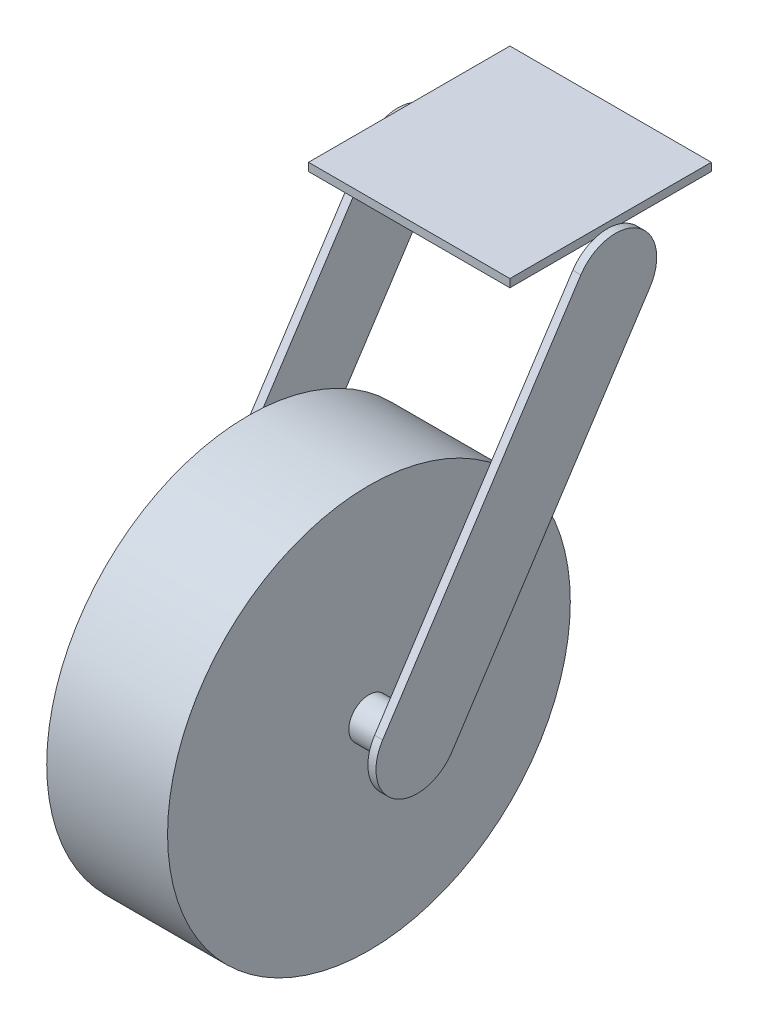
ISO-10303-21;
HEADER;
FILE_DESCRIPTION(('STEP AP214'),'2;1');
FILE_NAME('part.step','',(''),(''),'','','');
FILE_SCHEMA(('AUTOMOTIVE_DESIGN { 1 0 10303 214 1 1 1 1 }'));
ENDSEC;
DATA;
#1=APPLICATION_CONTEXT('core data for automotive mechanical design processes');
#2=APPLICATION_PROTOCOL_DEFINITION('international standard','automotive_design',2000,#1);
#3=PRODUCT_CONTEXT('',#1,'mechanical');
#4=PRODUCT('Part','Part','',(#3));
#5=PRODUCT_RELATED_PRODUCT_CATEGORY('part','',(#4));
#6=PRODUCT_DEFINITION_FORMATION('','',#4);
#7=PRODUCT_DEFINITION_CONTEXT('part definition',#1,'design');
#8=PRODUCT_DEFINITION('design','',#6,#7);
#9=PRODUCT_DEFINITION_SHAPE('','',#8);
#10=(LENGTH_UNIT() NAMED_UNIT(*) SI_UNIT(.MILLI.,.METRE.));
#11=(NAMED_UNIT(*) PLANE_ANGLE_UNIT() SI_UNIT($,.RADIAN.));
#12=(NAMED_UNIT(*) SI_UNIT($,.STERADIAN.) SOLID_ANGLE_UNIT());
#13=UNCERTAINTY_MEASURE_WITH_UNIT(LENGTH_MEASURE(1.E-05),#10,'distance_accuracy_value','');
#14=(GEOMETRIC_REPRESENTATION_CONTEXT(3) GLOBAL_UNCERTAINTY_ASSIGNED_CONTEXT((#13)) GLOBAL_UNIT_ASSIGNED_CONTEXT((#10,
#11,#12)) REPRESENTATION_CONTEXT('',''));
#15=CARTESIAN_POINT('',(0.,0.,0.));
#16=DIRECTION('',(0.,0.,1.));
#17=DIRECTION('',(1.,0.,0.));
#18=AXIS2_PLACEMENT_3D('',#15,#16,#17);
#19=CARTESIAN_POINT('',(-50.,0.,0.));
#20=DIRECTION('',(-1.,0.,0.));
#21=DIRECTION('',(0.,0.,1.));
#22=AXIS2_PLACEMENT_3D('',#19,#20,#21);
#23=PLANE('',#22);
#24=CARTESIAN_POINT('',(-50.,0.,0.));
#25=DIRECTION('',(-1.,0.,0.));
#26=DIRECTION('',(0.,0.,1.));
#27=AXIS2_PLACEMENT_3D('',#24,#25,#26);
#28=CIRCLE('',#27,10.);
#29=CARTESIAN_POINT('',(-50.,0.,10.));
#30=VERTEX_POINT('',#29);
#31=EDGE_CURVE('E233',#30,#30,#28,.T.);
#32=ORIENTED_EDGE('',*,*,#31,.T.);
#33=EDGE_LOOP('',(#32));
#34=FACE_BOUND('',#33,.T.);
#35=DIRECTION('',(0.,0.,1.));
#36=VECTOR('',#35,1.);
#37=CARTESIAN_POINT('',(-50.,170.,-150.));
#38=LINE('',#37,#36);
#39=CARTESIAN_POINT('',(-50.,170.,-105.402615925017));
#40=VERTEX_POINT('',#39);
#41=CARTESIAN_POINT('',(-50.,170.,-91.3976793086625));
#42=VERTEX_POINT('',#41);
#43=EDGE_CURVE('E49',#40,#42,#38,.T.);
#44=ORIENTED_EDGE('',*,*,#43,.T.);
#45=CARTESIAN_POINT('',(-50.,150.722960921633,-98.4001476168397));
#46=DIRECTION('',(-1.,0.,0.));
#47=DIRECTION('',(0.,0.,1.));
#48=AXIS2_PLACEMENT_3D('',#45,#46,#47);
#49=CIRCLE('',#48,20.5094806866461);
#50=CARTESIAN_POINT('',(-50.,161.934827183359,-81.2265384165266));
#51=VERTEX_POINT('',#50);
#52=EDGE_CURVE('E218',#51,#42,#49,.T.);
#53=ORIENTED_EDGE('',*,*,#52,.F.);
#54=DIRECTION('',(0.,0.837349782897962,-0.54666748676022));
#55=VECTOR('',#54,1.);
#56=CARTESIAN_POINT('',(-50.,11.2118662617261,17.173609200313));
#57=LINE('',#56,#55);
#58=CARTESIAN_POINT('',(-50.,11.2118662617261,17.173609200313));
#59=VERTEX_POINT('',#58);
#60=EDGE_CURVE('E215',#59,#51,#57,.T.);
#61=ORIENTED_EDGE('',*,*,#60,.F.);
#62=CARTESIAN_POINT('',(-50.,0.,0.));
#63=DIRECTION('',(-1.,0.,0.));
#64=DIRECTION('',(0.,0.,1.));
#65=AXIS2_PLACEMENT_3D('',#62,#63,#64);
#66=CIRCLE('',#65,20.5094806866461);
#67=CARTESIAN_POINT('',(-50.,-11.2118662617261,-17.173609200313));
#68=VERTEX_POINT('',#67);
#69=EDGE_CURVE('E201',#68,#59,#66,.T.);
#70=ORIENTED_EDGE('',*,*,#69,.F.);
#71=DIRECTION('',(0.,-0.837349782897962,0.546667486760221));
#72=VECTOR('',#71,1.);
#73=CARTESIAN_POINT('',(-50.,-11.2118662617261,-17.173609200313));
#74=LINE('',#73,#72);
#75=CARTESIAN_POINT('',(-50.,139.511094659907,-115.573756817153));
#76=VERTEX_POINT('',#75);
#77=EDGE_CURVE('E206',#76,#68,#74,.T.);
#78=ORIENTED_EDGE('',*,*,#77,.F.);
#79=EDGE_CURVE('E217',#40,#76,#49,.T.);
#80=ORIENTED_EDGE('',*,*,#79,.F.);
#81=EDGE_LOOP('',(#44,#53,#61,#70,#78,#80));
#82=FACE_BOUND('',#81,.T.);
#83=ADVANCED_FACE('F34',(#34,#82),#23,.F.);
#84=CARTESIAN_POINT('',(50.,0.,0.));
#85=DIRECTION('',(1.,0.,0.));
#86=DIRECTION('',(0.,0.,1.));
#87=AXIS2_PLACEMENT_3D('',#84,#85,#86);
#88=PLANE('',#87);
#89=CARTESIAN_POINT('',(50.,0.,0.));
#90=DIRECTION('',(1.,0.,0.));
#91=DIRECTION('',(0.,0.,-1.));
#92=AXIS2_PLACEMENT_3D('',#89,#90,#91);
#93=CIRCLE('',#92,10.);
#94=CARTESIAN_POINT('',(50.,0.,-10.));
#95=VERTEX_POINT('',#94);
#96=EDGE_CURVE('E237',#95,#95,#93,.T.);
#97=ORIENTED_EDGE('',*,*,#96,.T.);
#98=EDGE_LOOP('',(#97));
#99=FACE_BOUND('',#98,.T.);
#100=DIRECTION('',(0.,0.,1.));
#101=VECTOR('',#100,1.);
#102=CARTESIAN_POINT('',(50.,170.,0.));
#103=LINE('',#102,#101);
#104=CARTESIAN_POINT('',(50.,170.,-105.402615925017));
#105=VERTEX_POINT('',#104);
#106=CARTESIAN_POINT('',(50.,170.,-91.3976793086625));
#107=VERTEX_POINT('',#106);
#108=EDGE_CURVE('E11',#105,#107,#103,.T.);
#109=ORIENTED_EDGE('',*,*,#108,.F.);
#110=CARTESIAN_POINT('',(50.,150.722960921633,-98.4001476168397));
#111=DIRECTION('',(-1.,0.,0.));
#112=DIRECTION('',(0.,0.,1.));
#113=AXIS2_PLACEMENT_3D('',#110,#111,#112);
#114=CIRCLE('',#113,20.5094806866461);
#115=CARTESIAN_POINT('',(50.,139.511094659907,-115.573756817153));
#116=VERTEX_POINT('',#115);
#117=EDGE_CURVE('E187',#105,#116,#114,.T.);
#118=ORIENTED_EDGE('',*,*,#117,.T.);
#119=DIRECTION('',(0.,-0.837349782897962,0.546667486760221));
#120=VECTOR('',#119,1.);
#121=CARTESIAN_POINT('',(50.,-11.2118662617261,-17.173609200313));
#122=LINE('',#121,#120);
#123=CARTESIAN_POINT('',(50.,-11.2118662617261,-17.173609200313));
#124=VERTEX_POINT('',#123);
#125=EDGE_CURVE('E165',#116,#124,#122,.T.);
#126=ORIENTED_EDGE('',*,*,#125,.T.);
#127=CARTESIAN_POINT('',(50.,0.,0.));
#128=DIRECTION('',(-1.,0.,0.));
#129=DIRECTION('',(0.,0.,1.));
#130=AXIS2_PLACEMENT_3D('',#127,#128,#129);
#131=CIRCLE('',#130,20.5094806866461);
#132=CARTESIAN_POINT('',(50.,11.2118662617261,17.173609200313));
#133=VERTEX_POINT('',#132);
#134=EDGE_CURVE('E162',#124,#133,#131,.T.);
#135=ORIENTED_EDGE('',*,*,#134,.T.);
#136=DIRECTION('',(0.,0.837349782897962,-0.54666748676022));
#137=VECTOR('',#136,1.);
#138=CARTESIAN_POINT('',(50.,11.2118662617261,17.173609200313));
#139=LINE('',#138,#137);
#140=CARTESIAN_POINT('',(50.,161.934827183359,-81.2265384165266));
#141=VERTEX_POINT('',#140);
#142=EDGE_CURVE('E175',#133,#141,#139,.T.);
#143=ORIENTED_EDGE('',*,*,#142,.T.);
#144=EDGE_CURVE('E188',#141,#107,#114,.T.);
#145=ORIENTED_EDGE('',*,*,#144,.T.);
#146=EDGE_LOOP('',(#109,#118,#126,#135,#143,#145));
#147=FACE_BOUND('',#146,.T.);
#148=ADVANCED_FACE('F260',(#99,#147),#88,.F.);
#149=CARTESIAN_POINT('',(-30.,0.,0.));
#150=DIRECTION('',(1.,0.,0.));
#151=DIRECTION('',(0.,0.,-1.));
#152=AXIS2_PLACEMENT_3D('',#149,#150,#151);
#153=CYLINDRICAL_SURFACE('',#152,100.);
#154=CARTESIAN_POINT('',(-30.,0.,0.));
#155=DIRECTION('',(1.,0.,0.));
#156=DIRECTION('',(0.,0.,-1.));
#157=AXIS2_PLACEMENT_3D('',#154,#155,#156);
#158=CIRCLE('',#157,100.);
#159=CARTESIAN_POINT('',(-30.,0.,-100.));
#160=VERTEX_POINT('',#159);
#161=EDGE_CURVE('E245',#160,#160,#158,.T.);
#162=ORIENTED_EDGE('',*,*,#161,.T.);
#163=EDGE_LOOP('',(#162));
#164=FACE_BOUND('',#163,.T.);
#165=CARTESIAN_POINT('',(30.,0.,0.));
#166=DIRECTION('',(1.,0.,0.));
#167=DIRECTION('',(0.,0.,-1.));
#168=AXIS2_PLACEMENT_3D('',#165,#166,#167);
#169=CIRCLE('',#168,100.);
#170=CARTESIAN_POINT('',(30.,0.,-100.));
#171=VERTEX_POINT('',#170);
#172=EDGE_CURVE('E240',#171,#171,#169,.T.);
#173=ORIENTED_EDGE('',*,*,#172,.F.);
#174=EDGE_LOOP('',(#173));
#175=FACE_BOUND('',#174,.T.);
#176=ADVANCED_FACE('F36',(#164,#175),#153,.T.);
#177=CARTESIAN_POINT('',(-30.,0.,0.));
#178=DIRECTION('',(1.,0.,0.));
#179=DIRECTION('',(0.,0.,-1.));
#180=AXIS2_PLACEMENT_3D('',#177,#178,#179);
#181=PLANE('',#180);
#182=CARTESIAN_POINT('',(-30.,0.,0.));
#183=DIRECTION('',(1.,0.,0.));
#184=DIRECTION('',(0.,0.,-1.));
#185=AXIS2_PLACEMENT_3D('',#182,#183,#184);
#186=CIRCLE('',#185,10.);
#187=CARTESIAN_POINT('',(-30.,0.,-10.));
#188=VERTEX_POINT('',#187);
#189=EDGE_CURVE('E42',#188,#188,#186,.F.);
#190=ORIENTED_EDGE('',*,*,#189,.F.);
#191=EDGE_LOOP('',(#190));
#192=FACE_BOUND('',#191,.T.);
#193=ORIENTED_EDGE('',*,*,#161,.F.);
#194=EDGE_LOOP('',(#193));
#195=FACE_BOUND('',#194,.T.);
#196=ADVANCED_FACE('F252',(#192,#195),#181,.F.);
#197=CARTESIAN_POINT('',(30.,0.,0.));
#198=DIRECTION('',(1.,0.,0.));
#199=DIRECTION('',(0.,0.,-1.));
#200=AXIS2_PLACEMENT_3D('',#197,#198,#199);
#201=PLANE('',#200);
#202=CARTESIAN_POINT('',(30.,0.,0.));
#203=DIRECTION('',(1.,0.,0.));
#204=DIRECTION('',(0.,0.,-1.));
#205=AXIS2_PLACEMENT_3D('',#202,#203,#204);
#206=CIRCLE('',#205,10.);
#207=CARTESIAN_POINT('',(30.,0.,-10.));
#208=VERTEX_POINT('',#207);
#209=EDGE_CURVE('E236',#208,#208,#206,.T.);
#210=ORIENTED_EDGE('',*,*,#209,.F.);
#211=EDGE_LOOP('',(#210));
#212=FACE_BOUND('',#211,.T.);
#213=ORIENTED_EDGE('',*,*,#172,.T.);
#214=EDGE_LOOP('',(#213));
#215=FACE_BOUND('',#214,.T.);
#216=ADVANCED_FACE('F255',(#212,#215),#201,.T.);
#217=CARTESIAN_POINT('',(50.,0.,0.));
#218=DIRECTION('',(-1.,0.,0.));
#219=DIRECTION('',(0.,0.,1.));
#220=AXIS2_PLACEMENT_3D('',#217,#218,#219);
#221=CYLINDRICAL_SURFACE('',#220,10.);
#222=ORIENTED_EDGE('',*,*,#96,.F.);
#223=EDGE_LOOP('',(#222));
#224=FACE_BOUND('',#223,.T.);
#225=ORIENTED_EDGE('',*,*,#209,.T.);
#226=EDGE_LOOP('',(#225));
#227=FACE_BOUND('',#226,.T.);
#228=ADVANCED_FACE('F264',(#224,#227),#221,.T.);
#229=CARTESIAN_POINT('',(-50.,0.,0.));
#230=DIRECTION('',(1.,0.,0.));
#231=DIRECTION('',(0.,0.,-1.));
#232=AXIS2_PLACEMENT_3D('',#229,#230,#231);
#233=CYLINDRICAL_SURFACE('',#232,10.);
#234=ORIENTED_EDGE('',*,*,#31,.F.);
#235=EDGE_LOOP('',(#234));
#236=FACE_BOUND('',#235,.T.);
#237=ORIENTED_EDGE('',*,*,#189,.T.);
#238=EDGE_LOOP('',(#237));
#239=FACE_BOUND('',#238,.T.);
#240=ADVANCED_FACE('F250',(#236,#239),#233,.T.);
#241=CARTESIAN_POINT('',(-54.,0.,0.));
#242=DIRECTION('',(1.,0.,0.));
#243=DIRECTION('',(0.,0.,-1.));
#244=AXIS2_PLACEMENT_3D('',#241,#242,#243);
#245=CYLINDRICAL_SURFACE('',#244,20.5094806866461);
#246=ORIENTED_EDGE('',*,*,#69,.T.);
#247=DIRECTION('',(1.,0.,0.));
#248=VECTOR('',#247,1.);
#249=CARTESIAN_POINT('',(-54.,11.2118662617261,17.173609200313));
#250=LINE('',#249,#248);
#251=CARTESIAN_POINT('',(-54.,11.2118662617261,17.173609200313));
#252=VERTEX_POINT('',#251);
#253=EDGE_CURVE('E230',#252,#59,#250,.T.);
#254=ORIENTED_EDGE('',*,*,#253,.F.);
#255=CARTESIAN_POINT('',(-54.,0.,0.));
#256=DIRECTION('',(-1.,0.,0.));
#257=DIRECTION('',(0.,0.,1.));
#258=AXIS2_PLACEMENT_3D('',#255,#256,#257);
#259=CIRCLE('',#258,20.5094806866461);
#260=CARTESIAN_POINT('',(-54.,-11.2118662617261,-17.173609200313));
#261=VERTEX_POINT('',#260);
#262=EDGE_CURVE('E202',#261,#252,#259,.T.);
#263=ORIENTED_EDGE('',*,*,#262,.F.);
#264=DIRECTION('',(1.,0.,0.));
#265=VECTOR('',#264,1.);
#266=CARTESIAN_POINT('',(-54.,-11.2118662617261,-17.173609200313));
#267=LINE('',#266,#265);
#268=EDGE_CURVE('E212',#261,#68,#267,.T.);
#269=ORIENTED_EDGE('',*,*,#268,.T.);
#270=EDGE_LOOP('',(#246,#254,#263,#269));
#271=FACE_BOUND('',#270,.T.);
#272=ADVANCED_FACE('F296',(#271),#245,.T.);
#273=CARTESIAN_POINT('',(-54.,11.2118662617261,17.173609200313));
#274=DIRECTION('',(0.,-0.54666748676022,-0.837349782897962));
#275=DIRECTION('',(0.,0.837349782897962,-0.54666748676022));
#276=AXIS2_PLACEMENT_3D('',#273,#274,#275);
#277=PLANE('',#276);
#278=ORIENTED_EDGE('',*,*,#60,.T.);
#279=DIRECTION('',(1.,0.,0.));
#280=VECTOR('',#279,1.);
#281=CARTESIAN_POINT('',(-54.,161.934827183359,-81.2265384165266));
#282=LINE('',#281,#280);
#283=CARTESIAN_POINT('',(-54.,161.934827183359,-81.2265384165266));
#284=VERTEX_POINT('',#283);
#285=EDGE_CURVE('E227',#284,#51,#282,.T.);
#286=ORIENTED_EDGE('',*,*,#285,.F.);
#287=DIRECTION('',(0.,0.837349782897962,-0.54666748676022));
#288=VECTOR('',#287,1.);
#289=CARTESIAN_POINT('',(-54.,11.2118662617261,17.173609200313));
#290=LINE('',#289,#288);
#291=EDGE_CURVE('E205',#252,#284,#290,.T.);
#292=ORIENTED_EDGE('',*,*,#291,.F.);
#293=ORIENTED_EDGE('',*,*,#253,.T.);
#294=EDGE_LOOP('',(#278,#286,#292,#293));
#295=FACE_BOUND('',#294,.T.);
#296=ADVANCED_FACE('F292',(#295),#277,.F.);
#297=CARTESIAN_POINT('',(-54.,150.722960921633,-98.4001476168397));
#298=DIRECTION('',(1.,0.,0.));
#299=DIRECTION('',(0.,0.,-1.));
#300=AXIS2_PLACEMENT_3D('',#297,#298,#299);
#301=CYLINDRICAL_SURFACE('',#300,20.5094806866461);
#302=ORIENTED_EDGE('',*,*,#52,.T.);
#303=EDGE_CURVE('E220',#42,#40,#49,.T.);
#304=ORIENTED_EDGE('',*,*,#303,.T.);
#305=ORIENTED_EDGE('',*,*,#79,.T.);
#306=DIRECTION('',(1.,0.,0.));
#307=VECTOR('',#306,1.);
#308=CARTESIAN_POINT('',(-54.,139.511094659907,-115.573756817153));
#309=LINE('',#308,#307);
#310=CARTESIAN_POINT('',(-54.,139.511094659907,-115.573756817153));
#311=VERTEX_POINT('',#310);
#312=EDGE_CURVE('E224',#311,#76,#309,.T.);
#313=ORIENTED_EDGE('',*,*,#312,.F.);
#314=CARTESIAN_POINT('',(-54.,150.722960921633,-98.4001476168397));
#315=DIRECTION('',(-1.,0.,0.));
#316=DIRECTION('',(0.,0.,1.));
#317=AXIS2_PLACEMENT_3D('',#314,#315,#316);
#318=CIRCLE('',#317,20.5094806866461);
#319=EDGE_CURVE('E208',#284,#311,#318,.T.);
#320=ORIENTED_EDGE('',*,*,#319,.F.);
#321=ORIENTED_EDGE('',*,*,#285,.T.);
#322=EDGE_LOOP('',(#302,#304,#305,#313,#320,#321));
#323=FACE_BOUND('',#322,.T.);
#324=ADVANCED_FACE('F288',(#323),#301,.T.);
#325=CARTESIAN_POINT('',(-54.,-11.2118662617261,-17.173609200313));
#326=DIRECTION('',(0.,0.546667486760221,0.837349782897962));
#327=DIRECTION('',(0.,-0.837349782897962,0.546667486760221));
#328=AXIS2_PLACEMENT_3D('',#325,#326,#327);
#329=PLANE('',#328);
#330=ORIENTED_EDGE('',*,*,#77,.T.);
#331=ORIENTED_EDGE('',*,*,#268,.F.);
#332=DIRECTION('',(0.,-0.837349782897962,0.546667486760221));
#333=VECTOR('',#332,1.);
#334=CARTESIAN_POINT('',(-54.,-11.2118662617261,-17.173609200313));
#335=LINE('',#334,#333);
#336=EDGE_CURVE('E210',#311,#261,#335,.T.);
#337=ORIENTED_EDGE('',*,*,#336,.F.);
#338=ORIENTED_EDGE('',*,*,#312,.T.);
#339=EDGE_LOOP('',(#330,#331,#337,#338));
#340=FACE_BOUND('',#339,.T.);
#341=ADVANCED_FACE('F285',(#340),#329,.F.);
#342=CARTESIAN_POINT('',(-54.,0.,0.));
#343=DIRECTION('',(-1.,0.,0.));
#344=DIRECTION('',(0.,0.,1.));
#345=AXIS2_PLACEMENT_3D('',#342,#343,#344);
#346=PLANE('',#345);
#347=ORIENTED_EDGE('',*,*,#262,.T.);
#348=ORIENTED_EDGE('',*,*,#291,.T.);
#349=ORIENTED_EDGE('',*,*,#319,.T.);
#350=ORIENTED_EDGE('',*,*,#336,.T.);
#351=EDGE_LOOP('',(#347,#348,#349,#350));
#352=FACE_BOUND('',#351,.T.);
#353=ADVANCED_FACE('F283',(#352),#346,.T.);
#354=CARTESIAN_POINT('',(54.,0.,0.));
#355=DIRECTION('',(-1.,0.,0.));
#356=DIRECTION('',(0.,0.,1.));
#357=AXIS2_PLACEMENT_3D('',#354,#355,#356);
#358=CYLINDRICAL_SURFACE('',#357,20.5094806866461);
#359=ORIENTED_EDGE('',*,*,#134,.F.);
#360=DIRECTION('',(-1.,0.,0.));
#361=VECTOR('',#360,1.);
#362=CARTESIAN_POINT('',(54.,-11.2118662617261,-17.173609200313));
#363=LINE('',#362,#361);
#364=CARTESIAN_POINT('',(54.,-11.2118662617261,-17.173609200313));
#365=VERTEX_POINT('',#364);
#366=EDGE_CURVE('E199',#365,#124,#363,.T.);
#367=ORIENTED_EDGE('',*,*,#366,.F.);
#368=CARTESIAN_POINT('',(54.,0.,0.));
#369=DIRECTION('',(-1.,0.,0.));
#370=DIRECTION('',(0.,0.,1.));
#371=AXIS2_PLACEMENT_3D('',#368,#369,#370);
#372=CIRCLE('',#371,20.5094806866461);
#373=CARTESIAN_POINT('',(54.,11.2118662617261,17.173609200313));
#374=VERTEX_POINT('',#373);
#375=EDGE_CURVE('E171',#365,#374,#372,.T.);
#376=ORIENTED_EDGE('',*,*,#375,.T.);
#377=DIRECTION('',(-1.,0.,0.));
#378=VECTOR('',#377,1.);
#379=CARTESIAN_POINT('',(54.,11.2118662617261,17.173609200313));
#380=LINE('',#379,#378);
#381=EDGE_CURVE('E183',#374,#133,#380,.T.);
#382=ORIENTED_EDGE('',*,*,#381,.T.);
#383=EDGE_LOOP('',(#359,#367,#376,#382));
#384=FACE_BOUND('',#383,.T.);
#385=ADVANCED_FACE('F333',(#384),#358,.T.);
#386=CARTESIAN_POINT('',(54.,-11.2118662617261,-17.173609200313));
#387=DIRECTION('',(0.,-0.546667486760221,-0.837349782897962));
#388=DIRECTION('',(0.,0.837349782897962,-0.546667486760221));
#389=AXIS2_PLACEMENT_3D('',#386,#387,#388);
#390=PLANE('',#389);
#391=ORIENTED_EDGE('',*,*,#125,.F.);
#392=DIRECTION('',(-1.,0.,0.));
#393=VECTOR('',#392,1.);
#394=CARTESIAN_POINT('',(54.,139.511094659907,-115.573756817153));
#395=LINE('',#394,#393);
#396=CARTESIAN_POINT('',(54.,139.511094659907,-115.573756817153));
#397=VERTEX_POINT('',#396);
#398=EDGE_CURVE('E196',#397,#116,#395,.T.);
#399=ORIENTED_EDGE('',*,*,#398,.F.);
#400=DIRECTION('',(0.,-0.837349782897962,0.546667486760221));
#401=VECTOR('',#400,1.);
#402=CARTESIAN_POINT('',(54.,-11.2118662617261,-17.173609200313));
#403=LINE('',#402,#401);
#404=EDGE_CURVE('E174',#397,#365,#403,.T.);
#405=ORIENTED_EDGE('',*,*,#404,.T.);
#406=ORIENTED_EDGE('',*,*,#366,.T.);
#407=EDGE_LOOP('',(#391,#399,#405,#406));
#408=FACE_BOUND('',#407,.T.);
#409=ADVANCED_FACE('F340',(#408),#390,.T.);
#410=CARTESIAN_POINT('',(54.,150.722960921633,-98.4001476168397));
#411=DIRECTION('',(-1.,0.,0.));
#412=DIRECTION('',(0.,0.,1.));
#413=AXIS2_PLACEMENT_3D('',#410,#411,#412);
#414=CYLINDRICAL_SURFACE('',#413,20.5094806866461);
#415=ORIENTED_EDGE('',*,*,#144,.F.);
#416=DIRECTION('',(-1.,0.,0.));
#417=VECTOR('',#416,1.);
#418=CARTESIAN_POINT('',(54.,161.934827183359,-81.2265384165266));
#419=LINE('',#418,#417);
#420=CARTESIAN_POINT('',(54.,161.934827183359,-81.2265384165266));
#421=VERTEX_POINT('',#420);
#422=EDGE_CURVE('E194',#421,#141,#419,.T.);
#423=ORIENTED_EDGE('',*,*,#422,.F.);
#424=CARTESIAN_POINT('',(54.,150.722960921633,-98.4001476168397));
#425=DIRECTION('',(-1.,0.,0.));
#426=DIRECTION('',(0.,0.,1.));
#427=AXIS2_PLACEMENT_3D('',#424,#425,#426);
#428=CIRCLE('',#427,20.5094806866461);
#429=EDGE_CURVE('E178',#421,#397,#428,.T.);
#430=ORIENTED_EDGE('',*,*,#429,.T.);
#431=ORIENTED_EDGE('',*,*,#398,.T.);
#432=ORIENTED_EDGE('',*,*,#117,.F.);
#433=EDGE_CURVE('E190',#107,#105,#114,.T.);
#434=ORIENTED_EDGE('',*,*,#433,.F.);
#435=EDGE_LOOP('',(#415,#423,#430,#431,#432,#434));
#436=FACE_BOUND('',#435,.T.);
#437=ADVANCED_FACE('F347',(#436),#414,.T.);
#438=CARTESIAN_POINT('',(54.,11.2118662617261,17.173609200313));
#439=DIRECTION('',(0.,0.54666748676022,0.837349782897962));
#440=DIRECTION('',(0.,-0.837349782897962,0.54666748676022));
#441=AXIS2_PLACEMENT_3D('',#438,#439,#440);
#442=PLANE('',#441);
#443=ORIENTED_EDGE('',*,*,#142,.F.);
#444=ORIENTED_EDGE('',*,*,#381,.F.);
#445=DIRECTION('',(0.,0.837349782897962,-0.54666748676022));
#446=VECTOR('',#445,1.);
#447=CARTESIAN_POINT('',(54.,11.2118662617261,17.173609200313));
#448=LINE('',#447,#446);
#449=EDGE_CURVE('E181',#374,#421,#448,.T.);
#450=ORIENTED_EDGE('',*,*,#449,.T.);
#451=ORIENTED_EDGE('',*,*,#422,.T.);
#452=EDGE_LOOP('',(#443,#444,#450,#451));
#453=FACE_BOUND('',#452,.T.);
#454=ADVANCED_FACE('F355',(#453),#442,.T.);
#455=CARTESIAN_POINT('',(54.,0.,0.));
#456=DIRECTION('',(1.,0.,0.));
#457=DIRECTION('',(0.,0.,1.));
#458=AXIS2_PLACEMENT_3D('',#455,#456,#457);
#459=PLANE('',#458);
#460=ORIENTED_EDGE('',*,*,#375,.F.);
#461=ORIENTED_EDGE('',*,*,#404,.F.);
#462=ORIENTED_EDGE('',*,*,#429,.F.);
#463=ORIENTED_EDGE('',*,*,#449,.F.);
#464=EDGE_LOOP('',(#460,#461,#462,#463));
#465=FACE_BOUND('',#464,.T.);
#466=ADVANCED_FACE('F363',(#465),#459,.T.);
#467=CARTESIAN_POINT('',(-50.,174.,-150.));
#468=DIRECTION('',(1.,0.,0.));
#469=DIRECTION('',(0.,0.,-1.));
#470=AXIS2_PLACEMENT_3D('',#467,#468,#469);
#471=PLANE('',#470);
#472=CARTESIAN_POINT('',(-50.,170.,-150.));
#473=VERTEX_POINT('',#472);
#474=EDGE_CURVE('E479',#473,#40,#38,.T.);
#475=ORIENTED_EDGE('',*,*,#474,.T.);
#476=ORIENTED_EDGE('',*,*,#303,.F.);
#477=CARTESIAN_POINT('',(-50.,170.,-50.));
#478=VERTEX_POINT('',#477);
#479=EDGE_CURVE('E160',#42,#478,#38,.T.);
#480=ORIENTED_EDGE('',*,*,#479,.T.);
#481=DIRECTION('',(0.,-1.,0.));
#482=VECTOR('',#481,1.);
#483=CARTESIAN_POINT('',(-50.,174.,-50.));
#484=LINE('',#483,#482);
#485=CARTESIAN_POINT('',(-50.,174.,-50.));
#486=VERTEX_POINT('',#485);
#487=EDGE_CURVE('E139',#486,#478,#484,.T.);
#488=ORIENTED_EDGE('',*,*,#487,.F.);
#489=DIRECTION('',(0.,0.,1.));
#490=VECTOR('',#489,1.);
#491=CARTESIAN_POINT('',(-50.,174.,-150.));
#492=LINE('',#491,#490);
#493=CARTESIAN_POINT('',(-50.,174.,-150.));
#494=VERTEX_POINT('',#493);
#495=EDGE_CURVE('E145',#494,#486,#492,.T.);
#496=ORIENTED_EDGE('',*,*,#495,.F.);
#497=DIRECTION('',(0.,-1.,0.));
#498=VECTOR('',#497,1.);
#499=CARTESIAN_POINT('',(-50.,174.,-150.));
#500=LINE('',#499,#498);
#501=EDGE_CURVE('E492',#494,#473,#500,.T.);
#502=ORIENTED_EDGE('',*,*,#501,.T.);
#503=EDGE_LOOP('',(#475,#476,#480,#488,#496,#502));
#504=FACE_BOUND('',#503,.T.);
#505=ADVANCED_FACE('F157',(#504),#471,.F.);
#506=CARTESIAN_POINT('',(-50.,174.,-50.));
#507=DIRECTION('',(0.,0.,-1.));
#508=DIRECTION('',(-1.,0.,0.));
#509=AXIS2_PLACEMENT_3D('',#506,#507,#508);
#510=PLANE('',#509);
#511=DIRECTION('',(1.,0.,0.));
#512=VECTOR('',#511,1.);
#513=CARTESIAN_POINT('',(-50.,170.,-50.));
#514=LINE('',#513,#512);
#515=CARTESIAN_POINT('',(50.,170.,-50.));
#516=VERTEX_POINT('',#515);
#517=EDGE_CURVE('E481',#478,#516,#514,.T.);
#518=ORIENTED_EDGE('',*,*,#517,.T.);
#519=DIRECTION('',(0.,-1.,0.));
#520=VECTOR('',#519,1.);
#521=CARTESIAN_POINT('',(50.,174.,-50.));
#522=LINE('',#521,#520);
#523=CARTESIAN_POINT('',(50.,174.,-50.));
#524=VERTEX_POINT('',#523);
#525=EDGE_CURVE('E141',#524,#516,#522,.T.);
#526=ORIENTED_EDGE('',*,*,#525,.F.);
#527=DIRECTION('',(1.,0.,0.));
#528=VECTOR('',#527,1.);
#529=CARTESIAN_POINT('',(-50.,174.,-50.));
#530=LINE('',#529,#528);
#531=EDGE_CURVE('E135',#486,#524,#530,.T.);
#532=ORIENTED_EDGE('',*,*,#531,.F.);
#533=ORIENTED_EDGE('',*,*,#487,.T.);
#534=EDGE_LOOP('',(#518,#526,#532,#533));
#535=FACE_BOUND('',#534,.T.);
#536=ADVANCED_FACE('F137',(#535),#510,.F.);
#537=CARTESIAN_POINT('',(50.,174.,-150.));
#538=DIRECTION('',(-1.,0.,0.));
#539=DIRECTION('',(0.,0.,1.));
#540=AXIS2_PLACEMENT_3D('',#537,#538,#539);
#541=PLANE('',#540);
#542=ORIENTED_EDGE('',*,*,#433,.T.);
#543=DIRECTION('',(0.,0.,-1.));
#544=VECTOR('',#543,1.);
#545=CARTESIAN_POINT('',(50.,170.,-150.));
#546=LINE('',#545,#544);
#547=CARTESIAN_POINT('',(50.,170.,-150.));
#548=VERTEX_POINT('',#547);
#549=EDGE_CURVE('E483',#105,#548,#546,.T.);
#550=ORIENTED_EDGE('',*,*,#549,.T.);
#551=DIRECTION('',(0.,-1.,0.));
#552=VECTOR('',#551,1.);
#553=CARTESIAN_POINT('',(50.,174.,-150.));
#554=LINE('',#553,#552);
#555=CARTESIAN_POINT('',(50.,174.,-150.));
#556=VERTEX_POINT('',#555);
#557=EDGE_CURVE('E167',#556,#548,#554,.T.);
#558=ORIENTED_EDGE('',*,*,#557,.F.);
#559=DIRECTION('',(0.,0.,-1.));
#560=VECTOR('',#559,1.);
#561=CARTESIAN_POINT('',(50.,174.,-150.));
#562=LINE('',#561,#560);
#563=EDGE_CURVE('E144',#524,#556,#562,.T.);
#564=ORIENTED_EDGE('',*,*,#563,.F.);
#565=ORIENTED_EDGE('',*,*,#525,.T.);
#566=EDGE_CURVE('E488',#516,#107,#546,.T.);
#567=ORIENTED_EDGE('',*,*,#566,.T.);
#568=EDGE_LOOP('',(#542,#550,#558,#564,#565,#567));
#569=FACE_BOUND('',#568,.T.);
#570=ADVANCED_FACE('F383',(#569),#541,.F.);
#571=CARTESIAN_POINT('',(-50.,174.,-150.));
#572=DIRECTION('',(0.,0.,1.));
#573=DIRECTION('',(1.,0.,0.));
#574=AXIS2_PLACEMENT_3D('',#571,#572,#573);
#575=PLANE('',#574);
#576=DIRECTION('',(-1.,0.,0.));
#577=VECTOR('',#576,1.);
#578=CARTESIAN_POINT('',(-50.,170.,-150.));
#579=LINE('',#578,#577);
#580=EDGE_CURVE('E154',#548,#473,#579,.T.);
#581=ORIENTED_EDGE('',*,*,#580,.T.);
#582=ORIENTED_EDGE('',*,*,#501,.F.);
#583=DIRECTION('',(-1.,0.,0.));
#584=VECTOR('',#583,1.);
#585=CARTESIAN_POINT('',(-50.,174.,-150.));
#586=LINE('',#585,#584);
#587=EDGE_CURVE('E150',#556,#494,#586,.T.);
#588=ORIENTED_EDGE('',*,*,#587,.F.);
#589=ORIENTED_EDGE('',*,*,#557,.T.);
#590=EDGE_LOOP('',(#581,#582,#588,#589));
#591=FACE_BOUND('',#590,.T.);
#592=ADVANCED_FACE('F390',(#591),#575,.F.);
#593=CARTESIAN_POINT('',(0.,174.,0.));
#594=DIRECTION('',(0.,1.,0.));
#595=DIRECTION('',(0.,0.,1.));
#596=AXIS2_PLACEMENT_3D('',#593,#594,#595);
#597=PLANE('',#596);
#598=ORIENTED_EDGE('',*,*,#495,.T.);
#599=ORIENTED_EDGE('',*,*,#531,.T.);
#600=ORIENTED_EDGE('',*,*,#563,.T.);
#601=ORIENTED_EDGE('',*,*,#587,.T.);
#602=EDGE_LOOP('',(#598,#599,#600,#601));
#603=FACE_BOUND('',#602,.T.);
#604=ADVANCED_FACE('F148',(#603),#597,.T.);
#605=CARTESIAN_POINT('',(0.,170.,0.));
#606=DIRECTION('',(0.,1.,0.));
#607=DIRECTION('',(0.,0.,1.));
#608=AXIS2_PLACEMENT_3D('',#605,#606,#607);
#609=PLANE('',#608);
#610=ORIENTED_EDGE('',*,*,#474,.F.);
#611=ORIENTED_EDGE('',*,*,#580,.F.);
#612=ORIENTED_EDGE('',*,*,#549,.F.);
#613=ORIENTED_EDGE('',*,*,#108,.T.);
#614=ORIENTED_EDGE('',*,*,#566,.F.);
#615=ORIENTED_EDGE('',*,*,#517,.F.);
#616=ORIENTED_EDGE('',*,*,#479,.F.);
#617=ORIENTED_EDGE('',*,*,#43,.F.);
#618=EDGE_LOOP('',(#610,#611,#612,#613,#614,#615,#616,#617));
#619=FACE_BOUND('',#618,.T.);
#620=ADVANCED_FACE('F405',(#619),#609,.F.);
#621=CLOSED_SHELL('',(#83,#148,#176,#196,#216,#228,#240,#272,#296,#324,#341,#353,#385,#409,#437,
#454,#466,#505,#536,#570,#592,#604,#620));
#622=MANIFOLD_SOLID_BREP('B2',#621);
#623=ADVANCED_BREP_SHAPE_REPRESENTATION('',(#18,#622),#14);
#624=SHAPE_DEFINITION_REPRESENTATION(#9,#623);
ENDSEC;
END-ISO-10303-21;
